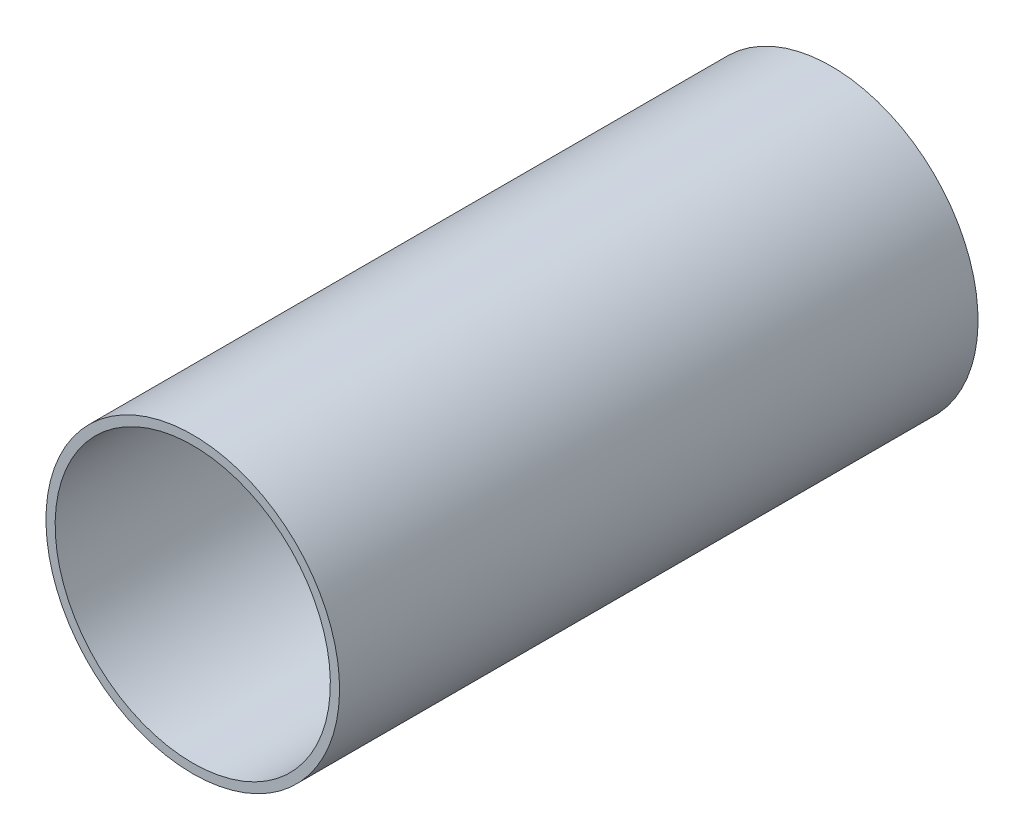
ISO-10303-21;
HEADER;
FILE_DESCRIPTION(('STEP AP214'),'2;1');
FILE_NAME('part.step','',(''),(''),'','','');
FILE_SCHEMA(('AUTOMOTIVE_DESIGN { 1 0 10303 214 1 1 1 1 }'));
ENDSEC;
DATA;
#1=APPLICATION_CONTEXT('core data for automotive mechanical design processes');
#2=APPLICATION_PROTOCOL_DEFINITION('international standard','automotive_design',2000,#1);
#3=PRODUCT_CONTEXT('',#1,'mechanical');
#4=PRODUCT('Part','Part','',(#3));
#5=PRODUCT_RELATED_PRODUCT_CATEGORY('part','',(#4));
#6=PRODUCT_DEFINITION_FORMATION('','',#4);
#7=PRODUCT_DEFINITION_CONTEXT('part definition',#1,'design');
#8=PRODUCT_DEFINITION('design','',#6,#7);
#9=PRODUCT_DEFINITION_SHAPE('','',#8);
#10=(LENGTH_UNIT() NAMED_UNIT(*) SI_UNIT(.MILLI.,.METRE.));
#11=(NAMED_UNIT(*) PLANE_ANGLE_UNIT() SI_UNIT($,.RADIAN.));
#12=(NAMED_UNIT(*) SI_UNIT($,.STERADIAN.) SOLID_ANGLE_UNIT());
#13=UNCERTAINTY_MEASURE_WITH_UNIT(LENGTH_MEASURE(1.E-05),#10,'distance_accuracy_value','');
#14=(GEOMETRIC_REPRESENTATION_CONTEXT(3) GLOBAL_UNCERTAINTY_ASSIGNED_CONTEXT((#13)) GLOBAL_UNIT_ASSIGNED_CONTEXT((#10,
#11,#12)) REPRESENTATION_CONTEXT('',''));
#15=CARTESIAN_POINT('',(0.,0.,0.));
#16=DIRECTION('',(0.,0.,1.));
#17=DIRECTION('',(1.,0.,0.));
#18=AXIS2_PLACEMENT_3D('',#15,#16,#17);
#19=CARTESIAN_POINT('',(170.307,-133.477,-0.045));
#20=DIRECTION('',(0.,0.,-1.));
#21=DIRECTION('',(0.,-1.,0.));
#22=AXIS2_PLACEMENT_3D('',#19,#20,#21);
#23=CYLINDRICAL_SURFACE('',#22,0.375);
#24=CARTESIAN_POINT('',(170.307,-133.477,-0.035));
#25=DIRECTION('',(0.,0.,-1.));
#26=DIRECTION('',(0.,-1.,0.));
#27=AXIS2_PLACEMENT_3D('',#24,#25,#26);
#28=CIRCLE('',#27,0.375);
#29=CARTESIAN_POINT('',(170.307,-133.852,-0.035));
#30=VERTEX_POINT('',#29);
#31=EDGE_CURVE('E64',#30,#30,#28,.T.);
#32=ORIENTED_EDGE('',*,*,#31,.T.);
#33=DIRECTION('',(0.,0.,1.));
#34=VECTOR('',#33,1.);
#35=CARTESIAN_POINT('',(170.307,-133.852,-0.045));
#36=LINE('',#35,#34);
#37=CARTESIAN_POINT('',(170.307,-133.852,1.705));
#38=VERTEX_POINT('',#37);
#39=EDGE_CURVE('E11',#30,#38,#36,.T.);
#40=ORIENTED_EDGE('',*,*,#39,.T.);
#41=CARTESIAN_POINT('',(170.307,-133.477,1.705));
#42=DIRECTION('',(0.,0.,-1.));
#43=DIRECTION('',(0.,-1.,0.));
#44=AXIS2_PLACEMENT_3D('',#41,#42,#43);
#45=CIRCLE('',#44,0.375);
#46=EDGE_CURVE('E25',#38,#38,#45,.T.);
#47=ORIENTED_EDGE('',*,*,#46,.F.);
#48=ORIENTED_EDGE('',*,*,#39,.F.);
#49=EDGE_LOOP('',(#32,#40,#47,#48));
#50=FACE_BOUND('',#49,.T.);
#51=ADVANCED_FACE('F17',(#50),#23,.F.);
#52=CARTESIAN_POINT('',(170.307,-133.877,1.705));
#53=DIRECTION('',(0.,0.,1.));
#54=DIRECTION('',(1.,0.,0.));
#55=AXIS2_PLACEMENT_3D('',#52,#53,#54);
#56=PLANE('',#55);
#57=ORIENTED_EDGE('',*,*,#46,.T.);
#58=EDGE_LOOP('',(#57));
#59=FACE_BOUND('',#58,.T.);
#60=CARTESIAN_POINT('',(170.307,-133.477,1.705));
#61=DIRECTION('',(0.,0.,1.));
#62=DIRECTION('',(0.,-1.,0.));
#63=AXIS2_PLACEMENT_3D('',#60,#61,#62);
#64=CIRCLE('',#63,0.4);
#65=CARTESIAN_POINT('',(170.307,-133.877,1.705));
#66=VERTEX_POINT('',#65);
#67=EDGE_CURVE('E56',#66,#66,#64,.T.);
#68=ORIENTED_EDGE('',*,*,#67,.T.);
#69=EDGE_LOOP('',(#68));
#70=FACE_BOUND('',#69,.T.);
#71=ADVANCED_FACE('F73',(#59,#70),#56,.T.);
#72=CARTESIAN_POINT('',(170.307,-133.877,-0.035));
#73=DIRECTION('',(0.,0.,1.));
#74=DIRECTION('',(1.,0.,0.));
#75=AXIS2_PLACEMENT_3D('',#72,#73,#74);
#76=PLANE('',#75);
#77=ORIENTED_EDGE('',*,*,#31,.F.);
#78=EDGE_LOOP('',(#77));
#79=FACE_BOUND('',#78,.T.);
#80=CARTESIAN_POINT('',(170.307,-133.477,-0.035));
#81=DIRECTION('',(0.,0.,1.));
#82=DIRECTION('',(0.,-1.,0.));
#83=AXIS2_PLACEMENT_3D('',#80,#81,#82);
#84=CIRCLE('',#83,0.4);
#85=CARTESIAN_POINT('',(170.307,-133.877,-0.035));
#86=VERTEX_POINT('',#85);
#87=EDGE_CURVE('E55',#86,#86,#84,.T.);
#88=ORIENTED_EDGE('',*,*,#87,.F.);
#89=EDGE_LOOP('',(#88));
#90=FACE_BOUND('',#89,.T.);
#91=ADVANCED_FACE('F82',(#79,#90),#76,.F.);
#92=CARTESIAN_POINT('',(170.307,-133.477,-0.035));
#93=DIRECTION('',(0.,0.,-1.));
#94=DIRECTION('',(0.,-1.,0.));
#95=AXIS2_PLACEMENT_3D('',#92,#93,#94);
#96=CYLINDRICAL_SURFACE('',#95,0.4);
#97=ORIENTED_EDGE('',*,*,#87,.T.);
#98=DIRECTION('',(0.,0.,1.));
#99=VECTOR('',#98,1.);
#100=CARTESIAN_POINT('',(170.307,-133.877,-0.035));
#101=LINE('',#100,#99);
#102=EDGE_CURVE('E52',#86,#66,#101,.T.);
#103=ORIENTED_EDGE('',*,*,#102,.T.);
#104=ORIENTED_EDGE('',*,*,#67,.F.);
#105=ORIENTED_EDGE('',*,*,#102,.F.);
#106=EDGE_LOOP('',(#97,#103,#104,#105));
#107=FACE_BOUND('',#106,.T.);
#108=ADVANCED_FACE('F53',(#107),#96,.T.);
#109=CLOSED_SHELL('',(#51,#71,#91,#108));
#110=MANIFOLD_SOLID_BREP('B1',#109);
#111=ADVANCED_BREP_SHAPE_REPRESENTATION('',(#18,#110),#14);
#112=SHAPE_DEFINITION_REPRESENTATION(#9,#111);
ENDSEC;
END-ISO-10303-21;
